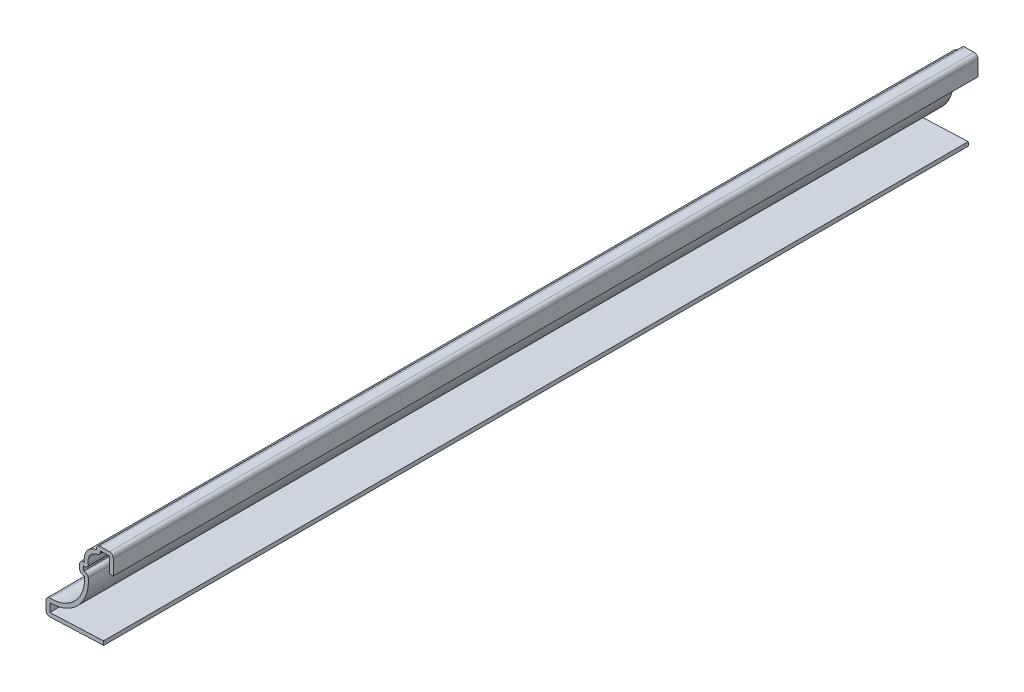
ISO-10303-21;
HEADER;
FILE_DESCRIPTION(('STEP AP214'),'2;1');
FILE_NAME('part.step','',(''),(''),'','','');
FILE_SCHEMA(('AUTOMOTIVE_DESIGN { 1 0 10303 214 1 1 1 1 }'));
ENDSEC;
DATA;
#1=APPLICATION_CONTEXT('core data for automotive mechanical design processes');
#2=APPLICATION_PROTOCOL_DEFINITION('international standard','automotive_design',2000,#1);
#3=PRODUCT_CONTEXT('',#1,'mechanical');
#4=PRODUCT('Part','Part','',(#3));
#5=PRODUCT_RELATED_PRODUCT_CATEGORY('part','',(#4));
#6=PRODUCT_DEFINITION_FORMATION('','',#4);
#7=PRODUCT_DEFINITION_CONTEXT('part definition',#1,'design');
#8=PRODUCT_DEFINITION('design','',#6,#7);
#9=PRODUCT_DEFINITION_SHAPE('','',#8);
#10=(LENGTH_UNIT() NAMED_UNIT(*) SI_UNIT(.MILLI.,.METRE.));
#11=(NAMED_UNIT(*) PLANE_ANGLE_UNIT() SI_UNIT($,.RADIAN.));
#12=(NAMED_UNIT(*) SI_UNIT($,.STERADIAN.) SOLID_ANGLE_UNIT());
#13=UNCERTAINTY_MEASURE_WITH_UNIT(LENGTH_MEASURE(1.E-05),#10,'distance_accuracy_value','');
#14=(GEOMETRIC_REPRESENTATION_CONTEXT(3) GLOBAL_UNCERTAINTY_ASSIGNED_CONTEXT((#13)) GLOBAL_UNIT_ASSIGNED_CONTEXT((#10,
#11,#12)) REPRESENTATION_CONTEXT('',''));
#15=CARTESIAN_POINT('',(0.,0.,0.));
#16=DIRECTION('',(0.,0.,1.));
#17=DIRECTION('',(1.,0.,0.));
#18=AXIS2_PLACEMENT_3D('',#15,#16,#17);
#19=CARTESIAN_POINT('',(1.905,27.78125,-285.75));
#20=DIRECTION('',(-1.,0.,0.));
#21=DIRECTION('',(0.,-1.,0.));
#22=AXIS2_PLACEMENT_3D('',#19,#20,#21);
#23=PLANE('',#22);
#24=DIRECTION('',(0.,-1.,0.));
#25=VECTOR('',#24,1.);
#26=CARTESIAN_POINT('',(1.905,27.78125,0.));
#27=LINE('',#26,#25);
#28=CARTESIAN_POINT('',(1.905,26.51125,0.));
#29=VERTEX_POINT('',#28);
#30=CARTESIAN_POINT('',(1.905,21.43125,0.));
#31=VERTEX_POINT('',#30);
#32=EDGE_CURVE('E350',#29,#31,#27,.T.);
#33=ORIENTED_EDGE('',*,*,#32,.F.);
#34=DIRECTION('',(0.,0.,1.));
#35=VECTOR('',#34,1.);
#36=CARTESIAN_POINT('',(1.905,26.51125,-285.75));
#37=LINE('',#36,#35);
#38=CARTESIAN_POINT('',(1.905,26.51125,-285.75));
#39=VERTEX_POINT('',#38);
#40=EDGE_CURVE('E274',#39,#29,#37,.T.);
#41=ORIENTED_EDGE('',*,*,#40,.F.);
#42=DIRECTION('',(0.,-1.,0.));
#43=VECTOR('',#42,1.);
#44=CARTESIAN_POINT('',(1.905,27.78125,-285.75));
#45=LINE('',#44,#43);
#46=CARTESIAN_POINT('',(1.905,21.43125,-285.75));
#47=VERTEX_POINT('',#46);
#48=EDGE_CURVE('E253',#39,#47,#45,.T.);
#49=ORIENTED_EDGE('',*,*,#48,.T.);
#50=DIRECTION('',(0.,0.,1.));
#51=VECTOR('',#50,1.);
#52=CARTESIAN_POINT('',(1.905,21.43125,-285.75));
#53=LINE('',#52,#51);
#54=EDGE_CURVE('E263',#47,#31,#53,.T.);
#55=ORIENTED_EDGE('',*,*,#54,.T.);
#56=EDGE_LOOP('',(#33,#41,#49,#55));
#57=FACE_BOUND('',#56,.T.);
#58=ADVANCED_FACE('F41',(#57),#23,.T.);
#59=CARTESIAN_POINT('',(-2.38125,26.51125,-285.75));
#60=DIRECTION('',(0.,-1.,0.));
#61=DIRECTION('',(0.,0.,-1.));
#62=AXIS2_PLACEMENT_3D('',#59,#60,#61);
#63=PLANE('',#62);
#64=DIRECTION('',(1.,0.,0.));
#65=VECTOR('',#64,1.);
#66=CARTESIAN_POINT('',(-2.38125,26.51125,0.));
#67=LINE('',#66,#65);
#68=CARTESIAN_POINT('',(-1.11125,26.51125,0.));
#69=VERTEX_POINT('',#68);
#70=EDGE_CURVE('E276',#69,#29,#67,.T.);
#71=ORIENTED_EDGE('',*,*,#70,.F.);
#72=DIRECTION('',(0.,0.,1.));
#73=VECTOR('',#72,1.);
#74=CARTESIAN_POINT('',(-1.11125,26.51125,-285.75));
#75=LINE('',#74,#73);
#76=CARTESIAN_POINT('',(-1.11125,26.51125,-285.75));
#77=VERTEX_POINT('',#76);
#78=EDGE_CURVE('E425',#77,#69,#75,.T.);
#79=ORIENTED_EDGE('',*,*,#78,.F.);
#80=DIRECTION('',(1.,0.,0.));
#81=VECTOR('',#80,1.);
#82=CARTESIAN_POINT('',(-2.38125,26.51125,-285.75));
#83=LINE('',#82,#81);
#84=EDGE_CURVE('E272',#77,#39,#83,.T.);
#85=ORIENTED_EDGE('',*,*,#84,.T.);
#86=ORIENTED_EDGE('',*,*,#40,.T.);
#87=EDGE_LOOP('',(#71,#79,#85,#86));
#88=FACE_BOUND('',#87,.T.);
#89=ADVANCED_FACE('F638',(#88),#63,.T.);
#90=CARTESIAN_POINT('',(-1.11125,26.19375,-285.75));
#91=DIRECTION('',(1.,0.,0.));
#92=DIRECTION('',(0.,1.,0.));
#93=AXIS2_PLACEMENT_3D('',#90,#91,#92);
#94=PLANE('',#93);
#95=DIRECTION('',(0.,1.,0.));
#96=VECTOR('',#95,1.);
#97=CARTESIAN_POINT('',(-1.11125,26.19375,0.));
#98=LINE('',#97,#96);
#99=CARTESIAN_POINT('',(-1.11125,26.19375,0.));
#100=VERTEX_POINT('',#99);
#101=EDGE_CURVE('E280',#100,#69,#98,.T.);
#102=ORIENTED_EDGE('',*,*,#101,.F.);
#103=DIRECTION('',(0.,0.,1.));
#104=VECTOR('',#103,1.);
#105=CARTESIAN_POINT('',(-1.11125,26.19375,-285.75));
#106=LINE('',#105,#104);
#107=CARTESIAN_POINT('',(-1.11125,26.19375,-285.75));
#108=VERTEX_POINT('',#107);
#109=EDGE_CURVE('E533',#100,#108,#106,.F.);
#110=ORIENTED_EDGE('',*,*,#109,.T.);
#111=DIRECTION('',(0.,1.,0.));
#112=VECTOR('',#111,1.);
#113=CARTESIAN_POINT('',(-1.11125,26.19375,-285.75));
#114=LINE('',#113,#112);
#115=EDGE_CURVE('E345',#108,#77,#114,.T.);
#116=ORIENTED_EDGE('',*,*,#115,.T.);
#117=ORIENTED_EDGE('',*,*,#78,.T.);
#118=EDGE_LOOP('',(#102,#110,#116,#117));
#119=FACE_BOUND('',#118,.T.);
#120=ADVANCED_FACE('F643',(#119),#94,.T.);
#121=CARTESIAN_POINT('',(-1.66362750041689,21.4856267860121,-285.75));
#122=DIRECTION('',(0.,0.,1.));
#123=DIRECTION('',(1.,0.,0.));
#124=AXIS2_PLACEMENT_3D('',#121,#122,#123);
#125=CYLINDRICAL_SURFACE('',#124,3.4925);
#126=CARTESIAN_POINT('',(-1.66362750041689,21.4856267860121,-285.75));
#127=DIRECTION('',(0.,0.,1.));
#128=DIRECTION('',(1.,0.,0.));
#129=AXIS2_PLACEMENT_3D('',#126,#127,#128);
#130=CIRCLE('',#129,3.4925);
#131=CARTESIAN_POINT('',(-5.10030066677784,20.8636671429366,-285.75));
#132=VERTEX_POINT('',#131);
#133=CARTESIAN_POINT('',(-2.18988400011117,24.9382504762699,-285.75));
#134=VERTEX_POINT('',#133);
#135=EDGE_CURVE('E341',#132,#134,#130,.F.);
#136=ORIENTED_EDGE('',*,*,#135,.T.);
#137=DIRECTION('',(0.,0.,1.));
#138=VECTOR('',#137,1.);
#139=CARTESIAN_POINT('',(-2.18988400011117,24.9382504762699,-285.75));
#140=LINE('',#139,#138);
#141=CARTESIAN_POINT('',(-2.18988400011117,24.9382504762699,0.));
#142=VERTEX_POINT('',#141);
#143=EDGE_CURVE('E529',#134,#142,#140,.T.);
#144=ORIENTED_EDGE('',*,*,#143,.T.);
#145=CARTESIAN_POINT('',(-1.66362750041689,21.4856267860121,0.));
#146=DIRECTION('',(0.,0.,1.));
#147=DIRECTION('',(1.,0.,0.));
#148=AXIS2_PLACEMENT_3D('',#145,#146,#147);
#149=CIRCLE('',#148,3.4925);
#150=CARTESIAN_POINT('',(-5.10030066677784,20.8636671429366,0.));
#151=VERTEX_POINT('',#150);
#152=EDGE_CURVE('E416',#151,#142,#149,.F.);
#153=ORIENTED_EDGE('',*,*,#152,.F.);
#154=DIRECTION('',(0.,0.,1.));
#155=VECTOR('',#154,1.);
#156=CARTESIAN_POINT('',(-5.10030066677784,20.8636671429366,-285.75));
#157=LINE('',#156,#155);
#158=EDGE_CURVE('E526',#151,#132,#157,.F.);
#159=ORIENTED_EDGE('',*,*,#158,.T.);
#160=EDGE_LOOP('',(#136,#144,#153,#159));
#161=FACE_BOUND('',#160,.T.);
#162=ADVANCED_FACE('F850',(#161),#125,.F.);
#163=CARTESIAN_POINT('',(-7.9375,19.3675,-285.75));
#164=DIRECTION('',(0.,-1.,0.));
#165=DIRECTION('',(0.,0.,-1.));
#166=AXIS2_PLACEMENT_3D('',#163,#164,#165);
#167=PLANE('',#166);
#168=DIRECTION('',(1.,0.,0.));
#169=VECTOR('',#168,1.);
#170=CARTESIAN_POINT('',(-7.9375,19.3675,-285.75));
#171=LINE('',#170,#169);
#172=CARTESIAN_POINT('',(-6.6675,19.3675,-285.75));
#173=VERTEX_POINT('',#172);
#174=CARTESIAN_POINT('',(-6.35,19.3675,-285.75));
#175=VERTEX_POINT('',#174);
#176=EDGE_CURVE('E337',#173,#175,#171,.T.);
#177=ORIENTED_EDGE('',*,*,#176,.T.);
#178=DIRECTION('',(0.,0.,1.));
#179=VECTOR('',#178,1.);
#180=CARTESIAN_POINT('',(-6.35,19.3675,-285.75));
#181=LINE('',#180,#179);
#182=CARTESIAN_POINT('',(-6.35,19.3675,0.));
#183=VERTEX_POINT('',#182);
#184=EDGE_CURVE('E545',#175,#183,#181,.T.);
#185=ORIENTED_EDGE('',*,*,#184,.T.);
#186=DIRECTION('',(1.,0.,0.));
#187=VECTOR('',#186,1.);
#188=CARTESIAN_POINT('',(-7.9375,19.3675,0.));
#189=LINE('',#188,#187);
#190=CARTESIAN_POINT('',(-6.6675,19.3675,0.));
#191=VERTEX_POINT('',#190);
#192=EDGE_CURVE('E412',#191,#183,#189,.T.);
#193=ORIENTED_EDGE('',*,*,#192,.F.);
#194=DIRECTION('',(0.,0.,1.));
#195=VECTOR('',#194,1.);
#196=CARTESIAN_POINT('',(-6.6675,19.3675,-285.75));
#197=LINE('',#196,#195);
#198=EDGE_CURVE('E429',#173,#191,#197,.T.);
#199=ORIENTED_EDGE('',*,*,#198,.F.);
#200=EDGE_LOOP('',(#177,#185,#193,#199));
#201=FACE_BOUND('',#200,.T.);
#202=ADVANCED_FACE('F845',(#201),#167,.T.);
#203=CARTESIAN_POINT('',(-6.6675,16.66875,-285.75));
#204=DIRECTION('',(1.,0.,0.));
#205=DIRECTION('',(0.,0.,-1.));
#206=AXIS2_PLACEMENT_3D('',#203,#204,#205);
#207=PLANE('',#206);
#208=DIRECTION('',(0.,1.,0.));
#209=VECTOR('',#208,1.);
#210=CARTESIAN_POINT('',(-6.6675,16.66875,0.));
#211=LINE('',#210,#209);
#212=CARTESIAN_POINT('',(-6.6675,17.93875,0.));
#213=VERTEX_POINT('',#212);
#214=EDGE_CURVE('E408',#213,#191,#211,.T.);
#215=ORIENTED_EDGE('',*,*,#214,.F.);
#216=DIRECTION('',(0.,0.,1.));
#217=VECTOR('',#216,1.);
#218=CARTESIAN_POINT('',(-6.6675,17.93875,-285.75));
#219=LINE('',#218,#217);
#220=CARTESIAN_POINT('',(-6.6675,17.93875,-285.75));
#221=VERTEX_POINT('',#220);
#222=EDGE_CURVE('E432',#221,#213,#219,.T.);
#223=ORIENTED_EDGE('',*,*,#222,.F.);
#224=DIRECTION('',(0.,1.,0.));
#225=VECTOR('',#224,1.);
#226=CARTESIAN_POINT('',(-6.6675,16.66875,-285.75));
#227=LINE('',#226,#225);
#228=EDGE_CURVE('E333',#221,#173,#227,.T.);
#229=ORIENTED_EDGE('',*,*,#228,.T.);
#230=ORIENTED_EDGE('',*,*,#198,.T.);
#231=EDGE_LOOP('',(#215,#223,#229,#230));
#232=FACE_BOUND('',#231,.T.);
#233=ADVANCED_FACE('F837',(#232),#207,.T.);
#234=CARTESIAN_POINT('',(-6.35,17.93875,-285.75));
#235=DIRECTION('',(0.,1.,0.));
#236=DIRECTION('',(0.,0.,1.));
#237=AXIS2_PLACEMENT_3D('',#234,#235,#236);
#238=PLANE('',#237);
#239=DIRECTION('',(1.,0.,0.));
#240=VECTOR('',#239,1.);
#241=CARTESIAN_POINT('',(-6.35,17.93875,0.));
#242=LINE('',#241,#240);
#243=CARTESIAN_POINT('',(-6.35,17.93875,0.));
#244=VERTEX_POINT('',#243);
#245=EDGE_CURVE('E405',#244,#213,#242,.F.);
#246=ORIENTED_EDGE('',*,*,#245,.F.);
#247=DIRECTION('',(0.,0.,1.));
#248=VECTOR('',#247,1.);
#249=CARTESIAN_POINT('',(-6.35,17.93875,-285.75));
#250=LINE('',#249,#248);
#251=CARTESIAN_POINT('',(-6.35,17.93875,-285.75));
#252=VERTEX_POINT('',#251);
#253=EDGE_CURVE('E542',#244,#252,#250,.F.);
#254=ORIENTED_EDGE('',*,*,#253,.T.);
#255=DIRECTION('',(1.,0.,0.));
#256=VECTOR('',#255,1.);
#257=CARTESIAN_POINT('',(-6.35,17.93875,-285.75));
#258=LINE('',#257,#256);
#259=EDGE_CURVE('E330',#252,#221,#258,.F.);
#260=ORIENTED_EDGE('',*,*,#259,.T.);
#261=ORIENTED_EDGE('',*,*,#222,.T.);
#262=EDGE_LOOP('',(#246,#254,#260,#261));
#263=FACE_BOUND('',#262,.T.);
#264=ADVANCED_FACE('F825',(#263),#238,.T.);
#265=CARTESIAN_POINT('',(-17.4249125813305,15.7555317534192,-285.75));
#266=DIRECTION('',(0.,0.,1.));
#267=DIRECTION('',(1.,0.,0.));
#268=AXIS2_PLACEMENT_3D('',#265,#266,#267);
#269=CYLINDRICAL_SURFACE('',#268,12.3825);
#270=CARTESIAN_POINT('',(-17.4249125813305,15.7555317534192,-285.75));
#271=DIRECTION('',(0.,0.,1.));
#272=DIRECTION('',(1.,0.,0.));
#273=AXIS2_PLACEMENT_3D('',#270,#271,#272);
#274=CIRCLE('',#273,12.3825);
#275=CARTESIAN_POINT('',(-17.78,3.37812414216621,-285.75));
#276=VERTEX_POINT('',#275);
#277=CARTESIAN_POINT('',(-5.08429570499081,16.7731177996092,-285.75));
#278=VERTEX_POINT('',#277);
#279=EDGE_CURVE('E326',#276,#278,#274,.T.);
#280=ORIENTED_EDGE('',*,*,#279,.T.);
#281=DIRECTION('',(0.,0.,1.));
#282=VECTOR('',#281,1.);
#283=CARTESIAN_POINT('',(-5.0842957049908,16.7731177996092,-285.75));
#284=LINE('',#283,#282);
#285=CARTESIAN_POINT('',(-5.08429570499081,16.7731177996092,0.));
#286=VERTEX_POINT('',#285);
#287=EDGE_CURVE('E538',#278,#286,#284,.T.);
#288=ORIENTED_EDGE('',*,*,#287,.T.);
#289=CARTESIAN_POINT('',(-17.4249125813305,15.7555317534192,0.));
#290=DIRECTION('',(0.,0.,1.));
#291=DIRECTION('',(1.,0.,0.));
#292=AXIS2_PLACEMENT_3D('',#289,#290,#291);
#293=CIRCLE('',#292,12.3825);
#294=CARTESIAN_POINT('',(-17.78,3.37812414216621,0.));
#295=VERTEX_POINT('',#294);
#296=EDGE_CURVE('E401',#295,#286,#293,.T.);
#297=ORIENTED_EDGE('',*,*,#296,.F.);
#298=DIRECTION('',(0.,0.,1.));
#299=VECTOR('',#298,1.);
#300=CARTESIAN_POINT('',(-17.78,3.37812414216621,-285.75));
#301=LINE('',#300,#299);
#302=EDGE_CURVE('E436',#276,#295,#301,.T.);
#303=ORIENTED_EDGE('',*,*,#302,.F.);
#304=EDGE_LOOP('',(#280,#288,#297,#303));
#305=FACE_BOUND('',#304,.T.);
#306=ADVANCED_FACE('F819',(#305),#269,.T.);
#307=CARTESIAN_POINT('',(-17.78,-0.79375,-285.75));
#308=DIRECTION('',(1.,0.,0.));
#309=DIRECTION('',(0.,0.,-1.));
#310=AXIS2_PLACEMENT_3D('',#307,#308,#309);
#311=PLANE('',#310);
#312=DIRECTION('',(0.,1.,0.));
#313=VECTOR('',#312,1.);
#314=CARTESIAN_POINT('',(-17.78,-0.79375,0.));
#315=LINE('',#314,#313);
#316=CARTESIAN_POINT('',(-17.78,0.53026861915164,0.));
#317=VERTEX_POINT('',#316);
#318=EDGE_CURVE('E397',#317,#295,#315,.T.);
#319=ORIENTED_EDGE('',*,*,#318,.F.);
#320=DIRECTION('',(0.,0.,1.));
#321=VECTOR('',#320,1.);
#322=CARTESIAN_POINT('',(-17.78,0.53026861915164,-285.75));
#323=LINE('',#322,#321);
#324=CARTESIAN_POINT('',(-17.78,0.53026861915164,-285.75));
#325=VERTEX_POINT('',#324);
#326=EDGE_CURVE('E439',#325,#317,#323,.T.);
#327=ORIENTED_EDGE('',*,*,#326,.F.);
#328=DIRECTION('',(0.,1.,0.));
#329=VECTOR('',#328,1.);
#330=CARTESIAN_POINT('',(-17.78,-0.79375,-285.75));
#331=LINE('',#330,#329);
#332=EDGE_CURVE('E322',#325,#276,#331,.T.);
#333=ORIENTED_EDGE('',*,*,#332,.T.);
#334=ORIENTED_EDGE('',*,*,#302,.T.);
#335=EDGE_LOOP('',(#319,#327,#333,#334));
#336=FACE_BOUND('',#335,.T.);
#337=ADVANCED_FACE('F824',(#336),#311,.T.);
#338=CARTESIAN_POINT('',(-0.0528707917844703,1.26889900282729,-285.75));
#339=DIRECTION('',(-0.0416305447121813,0.999133073092352,0.));
#340=DIRECTION('',(-0.999133073092352,-0.0416305447121813,0.));
#341=AXIS2_PLACEMENT_3D('',#338,#339,#340);
#342=PLANE('',#341);
#343=DIRECTION('',(-0.999133073092352,-0.0416305447121813,0.));
#344=VECTOR('',#343,1.);
#345=CARTESIAN_POINT('',(-0.0528707917844703,1.26889900282729,0.));
#346=LINE('',#345,#344);
#347=CARTESIAN_POINT('',(-0.0528707917844703,1.26889900282729,0.));
#348=VERTEX_POINT('',#347);
#349=EDGE_CURVE('E393',#348,#317,#346,.T.);
#350=ORIENTED_EDGE('',*,*,#349,.F.);
#351=DIRECTION('',(0.,0.,1.));
#352=VECTOR('',#351,1.);
#353=CARTESIAN_POINT('',(-0.0528707917844703,1.26889900282729,-285.75));
#354=LINE('',#353,#352);
#355=CARTESIAN_POINT('',(-0.0528707917844703,1.26889900282729,-285.75));
#356=VERTEX_POINT('',#355);
#357=EDGE_CURVE('E442',#356,#348,#354,.T.);
#358=ORIENTED_EDGE('',*,*,#357,.F.);
#359=DIRECTION('',(-0.999133073092352,-0.0416305447121813,0.));
#360=VECTOR('',#359,1.);
#361=CARTESIAN_POINT('',(-0.0528707917844703,1.26889900282729,-285.75));
#362=LINE('',#361,#360);
#363=EDGE_CURVE('E318',#356,#325,#362,.T.);
#364=ORIENTED_EDGE('',*,*,#363,.T.);
#365=ORIENTED_EDGE('',*,*,#326,.T.);
#366=EDGE_LOOP('',(#350,#358,#364,#365));
#367=FACE_BOUND('',#366,.T.);
#368=ADVANCED_FACE('F887',(#367),#342,.T.);
#369=CARTESIAN_POINT('',(-0.0528707917844703,1.26889900282729,-285.75));
#370=DIRECTION('',(-0.999133073092352,-0.0416305447121813,0.));
#371=DIRECTION('',(0.0416305447121813,-0.999133073092352,0.));
#372=AXIS2_PLACEMENT_3D('',#369,#370,#371);
#373=PLANE('',#372);
#374=DIRECTION('',(0.0416305447121813,-0.999133073092352,0.));
#375=VECTOR('',#374,1.);
#376=CARTESIAN_POINT('',(-0.0528707917844703,1.26889900282729,0.));
#377=LINE('',#376,#375);
#378=CARTESIAN_POINT('',(0.,0.,0.));
#379=VERTEX_POINT('',#378);
#380=EDGE_CURVE('E390',#348,#379,#377,.T.);
#381=ORIENTED_EDGE('',*,*,#380,.T.);
#382=DIRECTION('',(0.,0.,1.));
#383=VECTOR('',#382,1.);
#384=CARTESIAN_POINT('',(0.,0.,-285.75));
#385=LINE('',#384,#383);
#386=CARTESIAN_POINT('',(0.,0.,-285.75));
#387=VERTEX_POINT('',#386);
#388=EDGE_CURVE('E445',#387,#379,#385,.T.);
#389=ORIENTED_EDGE('',*,*,#388,.F.);
#390=DIRECTION('',(0.0416305447121813,-0.999133073092352,0.));
#391=VECTOR('',#390,1.);
#392=CARTESIAN_POINT('',(-0.0528707917844703,1.26889900282729,-285.75));
#393=LINE('',#392,#391);
#394=EDGE_CURVE('E315',#356,#387,#393,.T.);
#395=ORIENTED_EDGE('',*,*,#394,.F.);
#396=ORIENTED_EDGE('',*,*,#357,.T.);
#397=EDGE_LOOP('',(#381,#389,#395,#396));
#398=FACE_BOUND('',#397,.T.);
#399=ADVANCED_FACE('F812',(#398),#373,.F.);
#400=CARTESIAN_POINT('',(0.,0.,-285.75));
#401=DIRECTION('',(-0.0416305447121813,0.999133073092352,0.));
#402=DIRECTION('',(-0.999133073092352,-0.0416305447121813,0.));
#403=AXIS2_PLACEMENT_3D('',#400,#401,#402);
#404=PLANE('',#403);
#405=DIRECTION('',(-0.999133073092352,-0.0416305447121813,0.));
#406=VECTOR('',#405,1.);
#407=CARTESIAN_POINT('',(0.,0.,0.));
#408=LINE('',#407,#406);
#409=CARTESIAN_POINT('',(-17.7271292082155,-0.738630383675647,0.));
#410=VERTEX_POINT('',#409);
#411=EDGE_CURVE('E386',#379,#410,#408,.T.);
#412=ORIENTED_EDGE('',*,*,#411,.T.);
#413=DIRECTION('',(0.,0.,1.));
#414=VECTOR('',#413,1.);
#415=CARTESIAN_POINT('',(-17.7271292082155,-0.738630383675647,-285.75));
#416=LINE('',#415,#414);
#417=CARTESIAN_POINT('',(-17.7271292082155,-0.738630383675647,-285.75));
#418=VERTEX_POINT('',#417);
#419=EDGE_CURVE('E50',#410,#418,#416,.F.);
#420=ORIENTED_EDGE('',*,*,#419,.T.);
#421=DIRECTION('',(-0.999133073092352,-0.0416305447121813,0.));
#422=VECTOR('',#421,1.);
#423=CARTESIAN_POINT('',(0.,0.,-285.75));
#424=LINE('',#423,#422);
#425=EDGE_CURVE('E311',#387,#418,#424,.T.);
#426=ORIENTED_EDGE('',*,*,#425,.F.);
#427=ORIENTED_EDGE('',*,*,#388,.T.);
#428=EDGE_LOOP('',(#412,#420,#426,#427));
#429=FACE_BOUND('',#428,.T.);
#430=ADVANCED_FACE('F573',(#429),#404,.F.);
#431=CARTESIAN_POINT('',(-19.05,-0.79375,-285.75));
#432=DIRECTION('',(1.,0.,0.));
#433=DIRECTION('',(0.,0.,-1.));
#434=AXIS2_PLACEMENT_3D('',#431,#432,#433);
#435=PLANE('',#434);
#436=DIRECTION('',(0.,1.,0.));
#437=VECTOR('',#436,1.);
#438=CARTESIAN_POINT('',(-19.05,-0.79375,-285.75));
#439=LINE('',#438,#437);
#440=CARTESIAN_POINT('',(-19.05,0.530268619151639,-285.75));
#441=VERTEX_POINT('',#440);
#442=CARTESIAN_POINT('',(-19.05,3.37812414216621,-285.75));
#443=VERTEX_POINT('',#442);
#444=EDGE_CURVE('E307',#441,#443,#439,.T.);
#445=ORIENTED_EDGE('',*,*,#444,.F.);
#446=DIRECTION('',(0.,0.,1.));
#447=VECTOR('',#446,1.);
#448=CARTESIAN_POINT('',(-19.05,0.530268619151639,-285.75));
#449=LINE('',#448,#447);
#450=CARTESIAN_POINT('',(-19.05,0.530268619151639,0.));
#451=VERTEX_POINT('',#450);
#452=EDGE_CURVE('E566',#441,#451,#449,.T.);
#453=ORIENTED_EDGE('',*,*,#452,.T.);
#454=DIRECTION('',(0.,1.,0.));
#455=VECTOR('',#454,1.);
#456=CARTESIAN_POINT('',(-19.05,-0.79375,0.));
#457=LINE('',#456,#455);
#458=CARTESIAN_POINT('',(-19.05,3.37812414216621,0.));
#459=VERTEX_POINT('',#458);
#460=EDGE_CURVE('E382',#451,#459,#457,.T.);
#461=ORIENTED_EDGE('',*,*,#460,.T.);
#462=DIRECTION('',(0.,0.,1.));
#463=VECTOR('',#462,1.);
#464=CARTESIAN_POINT('',(-19.05,3.37812414216621,-285.75));
#465=LINE('',#464,#463);
#466=EDGE_CURVE('E563',#459,#443,#465,.F.);
#467=ORIENTED_EDGE('',*,*,#466,.T.);
#468=EDGE_LOOP('',(#445,#453,#461,#467));
#469=FACE_BOUND('',#468,.T.);
#470=ADVANCED_FACE('F585',(#469),#435,.F.);
#471=CARTESIAN_POINT('',(-17.4249125813305,15.7555317534192,-285.75));
#472=DIRECTION('',(0.,0.,1.));
#473=DIRECTION('',(1.,0.,0.));
#474=AXIS2_PLACEMENT_3D('',#471,#472,#473);
#475=CYLINDRICAL_SURFACE('',#474,11.1125);
#476=CARTESIAN_POINT('',(-17.4249125813305,15.7555317534192,-285.75));
#477=DIRECTION('',(0.,0.,1.));
#478=DIRECTION('',(1.,0.,0.));
#479=AXIS2_PLACEMENT_3D('',#476,#477,#478);
#480=CIRCLE('',#479,11.1125);
#481=CARTESIAN_POINT('',(-17.7435807775724,4.64760184588446,-285.75));
#482=VERTEX_POINT('',#481);
#483=CARTESIAN_POINT('',(-6.35,16.66875,-285.75));
#484=VERTEX_POINT('',#483);
#485=EDGE_CURVE('E304',#482,#484,#480,.T.);
#486=ORIENTED_EDGE('',*,*,#485,.F.);
#487=DIRECTION('',(0.,0.,1.));
#488=VECTOR('',#487,1.);
#489=CARTESIAN_POINT('',(-17.7435807775724,4.64760184588446,-285.75));
#490=LINE('',#489,#488);
#491=CARTESIAN_POINT('',(-17.7435807775724,4.64760184588446,0.));
#492=VERTEX_POINT('',#491);
#493=EDGE_CURVE('E11',#482,#492,#490,.T.);
#494=ORIENTED_EDGE('',*,*,#493,.T.);
#495=CARTESIAN_POINT('',(-17.4249125813305,15.7555317534192,0.));
#496=DIRECTION('',(0.,0.,1.));
#497=DIRECTION('',(1.,0.,0.));
#498=AXIS2_PLACEMENT_3D('',#495,#496,#497);
#499=CIRCLE('',#498,11.1125);
#500=CARTESIAN_POINT('',(-6.35,16.66875,0.));
#501=VERTEX_POINT('',#500);
#502=EDGE_CURVE('E379',#492,#501,#499,.T.);
#503=ORIENTED_EDGE('',*,*,#502,.T.);
#504=DIRECTION('',(0.,0.,1.));
#505=VECTOR('',#504,1.);
#506=CARTESIAN_POINT('',(-6.35,16.66875,-285.75));
#507=LINE('',#506,#505);
#508=EDGE_CURVE('E449',#484,#501,#507,.T.);
#509=ORIENTED_EDGE('',*,*,#508,.F.);
#510=EDGE_LOOP('',(#486,#494,#503,#509));
#511=FACE_BOUND('',#510,.T.);
#512=ADVANCED_FACE('F597',(#511),#475,.F.);
#513=CARTESIAN_POINT('',(-6.35,16.66875,-285.75));
#514=DIRECTION('',(0.,1.,0.));
#515=DIRECTION('',(0.,0.,1.));
#516=AXIS2_PLACEMENT_3D('',#513,#514,#515);
#517=PLANE('',#516);
#518=DIRECTION('',(-1.,0.,0.));
#519=VECTOR('',#518,1.);
#520=CARTESIAN_POINT('',(-6.35,16.66875,0.));
#521=LINE('',#520,#519);
#522=CARTESIAN_POINT('',(-6.6675,16.66875,0.));
#523=VERTEX_POINT('',#522);
#524=EDGE_CURVE('E375',#501,#523,#521,.T.);
#525=ORIENTED_EDGE('',*,*,#524,.T.);
#526=DIRECTION('',(0.,0.,1.));
#527=VECTOR('',#526,1.);
#528=CARTESIAN_POINT('',(-6.6675,16.66875,-285.75));
#529=LINE('',#528,#527);
#530=CARTESIAN_POINT('',(-6.6675,16.66875,-285.75));
#531=VERTEX_POINT('',#530);
#532=EDGE_CURVE('E556',#523,#531,#529,.F.);
#533=ORIENTED_EDGE('',*,*,#532,.T.);
#534=DIRECTION('',(-1.,0.,0.));
#535=VECTOR('',#534,1.);
#536=CARTESIAN_POINT('',(-6.35,16.66875,-285.75));
#537=LINE('',#536,#535);
#538=EDGE_CURVE('E300',#484,#531,#537,.T.);
#539=ORIENTED_EDGE('',*,*,#538,.F.);
#540=ORIENTED_EDGE('',*,*,#508,.T.);
#541=EDGE_LOOP('',(#525,#533,#539,#540));
#542=FACE_BOUND('',#541,.T.);
#543=ADVANCED_FACE('F779',(#542),#517,.F.);
#544=CARTESIAN_POINT('',(-7.9375,16.66875,-285.75));
#545=DIRECTION('',(1.,0.,0.));
#546=DIRECTION('',(0.,0.,-1.));
#547=AXIS2_PLACEMENT_3D('',#544,#545,#546);
#548=PLANE('',#547);
#549=DIRECTION('',(0.,1.,0.));
#550=VECTOR('',#549,1.);
#551=CARTESIAN_POINT('',(-7.9375,16.66875,-285.75));
#552=LINE('',#551,#550);
#553=CARTESIAN_POINT('',(-7.9375,17.93875,-285.75));
#554=VERTEX_POINT('',#553);
#555=CARTESIAN_POINT('',(-7.9375,19.3675,-285.75));
#556=VERTEX_POINT('',#555);
#557=EDGE_CURVE('E297',#554,#556,#552,.T.);
#558=ORIENTED_EDGE('',*,*,#557,.F.);
#559=DIRECTION('',(0.,0.,1.));
#560=VECTOR('',#559,1.);
#561=CARTESIAN_POINT('',(-7.9375,17.93875,-285.75));
#562=LINE('',#561,#560);
#563=CARTESIAN_POINT('',(-7.9375,17.93875,0.));
#564=VERTEX_POINT('',#563);
#565=EDGE_CURVE('E552',#554,#564,#562,.T.);
#566=ORIENTED_EDGE('',*,*,#565,.T.);
#567=DIRECTION('',(0.,1.,0.));
#568=VECTOR('',#567,1.);
#569=CARTESIAN_POINT('',(-7.9375,16.66875,0.));
#570=LINE('',#569,#568);
#571=CARTESIAN_POINT('',(-7.9375,19.3675,0.));
#572=VERTEX_POINT('',#571);
#573=EDGE_CURVE('E371',#564,#572,#570,.T.);
#574=ORIENTED_EDGE('',*,*,#573,.T.);
#575=DIRECTION('',(0.,0.,1.));
#576=VECTOR('',#575,1.);
#577=CARTESIAN_POINT('',(-7.9375,19.3675,-285.75));
#578=LINE('',#577,#576);
#579=EDGE_CURVE('E549',#572,#556,#578,.F.);
#580=ORIENTED_EDGE('',*,*,#579,.T.);
#581=EDGE_LOOP('',(#558,#566,#574,#580));
#582=FACE_BOUND('',#581,.T.);
#583=ADVANCED_FACE('F609',(#582),#548,.F.);
#584=CARTESIAN_POINT('',(-7.9375,20.6375,-285.75));
#585=DIRECTION('',(0.,-1.,0.));
#586=DIRECTION('',(0.,0.,-1.));
#587=AXIS2_PLACEMENT_3D('',#584,#585,#586);
#588=PLANE('',#587);
#589=DIRECTION('',(1.,0.,0.));
#590=VECTOR('',#589,1.);
#591=CARTESIAN_POINT('',(-7.9375,20.6375,-285.75));
#592=LINE('',#591,#590);
#593=CARTESIAN_POINT('',(-6.6675,20.6375,-285.75));
#594=VERTEX_POINT('',#593);
#595=CARTESIAN_POINT('',(-6.35,20.6375,-285.75));
#596=VERTEX_POINT('',#595);
#597=EDGE_CURVE('E294',#594,#596,#592,.T.);
#598=ORIENTED_EDGE('',*,*,#597,.F.);
#599=DIRECTION('',(0.,0.,1.));
#600=VECTOR('',#599,1.);
#601=CARTESIAN_POINT('',(-6.6675,20.6375,-285.75));
#602=LINE('',#601,#600);
#603=CARTESIAN_POINT('',(-6.6675,20.6375,0.));
#604=VERTEX_POINT('',#603);
#605=EDGE_CURVE('E559',#594,#604,#602,.T.);
#606=ORIENTED_EDGE('',*,*,#605,.T.);
#607=DIRECTION('',(1.,0.,0.));
#608=VECTOR('',#607,1.);
#609=CARTESIAN_POINT('',(-7.9375,20.6375,0.));
#610=LINE('',#609,#608);
#611=CARTESIAN_POINT('',(-6.35,20.6375,0.));
#612=VERTEX_POINT('',#611);
#613=EDGE_CURVE('E368',#604,#612,#610,.T.);
#614=ORIENTED_EDGE('',*,*,#613,.T.);
#615=DIRECTION('',(0.,0.,1.));
#616=VECTOR('',#615,1.);
#617=CARTESIAN_POINT('',(-6.35,20.6375,-285.75));
#618=LINE('',#617,#616);
#619=EDGE_CURVE('E453',#596,#612,#618,.T.);
#620=ORIENTED_EDGE('',*,*,#619,.F.);
#621=EDGE_LOOP('',(#598,#606,#614,#620));
#622=FACE_BOUND('',#621,.T.);
#623=ADVANCED_FACE('F617',(#622),#588,.F.);
#624=CARTESIAN_POINT('',(-1.66362750041689,21.4856267860121,-285.75));
#625=DIRECTION('',(0.,0.,1.));
#626=DIRECTION('',(1.,0.,0.));
#627=AXIS2_PLACEMENT_3D('',#624,#625,#626);
#628=CYLINDRICAL_SURFACE('',#627,4.7625);
#629=CARTESIAN_POINT('',(-1.66362750041689,21.4856267860121,0.));
#630=DIRECTION('',(0.,0.,-1.));
#631=DIRECTION('',(-1.,0.,0.));
#632=AXIS2_PLACEMENT_3D('',#629,#630,#631);
#633=CIRCLE('',#632,4.7625);
#634=CARTESIAN_POINT('',(-2.38125,26.19375,0.));
#635=VERTEX_POINT('',#634);
#636=EDGE_CURVE('E365',#612,#635,#633,.T.);
#637=ORIENTED_EDGE('',*,*,#636,.T.);
#638=DIRECTION('',(0.,0.,1.));
#639=VECTOR('',#638,1.);
#640=CARTESIAN_POINT('',(-2.38125,26.19375,-285.75));
#641=LINE('',#640,#639);
#642=CARTESIAN_POINT('',(-2.38125,26.19375,-285.75));
#643=VERTEX_POINT('',#642);
#644=EDGE_CURVE('E457',#643,#635,#641,.T.);
#645=ORIENTED_EDGE('',*,*,#644,.F.);
#646=CARTESIAN_POINT('',(-1.66362750041689,21.4856267860121,-285.75));
#647=DIRECTION('',(0.,0.,-1.));
#648=DIRECTION('',(-1.,0.,0.));
#649=AXIS2_PLACEMENT_3D('',#646,#647,#648);
#650=CIRCLE('',#649,4.7625);
#651=EDGE_CURVE('E291',#596,#643,#650,.T.);
#652=ORIENTED_EDGE('',*,*,#651,.F.);
#653=ORIENTED_EDGE('',*,*,#619,.T.);
#654=EDGE_LOOP('',(#637,#645,#652,#653));
#655=FACE_BOUND('',#654,.T.);
#656=ADVANCED_FACE('F623',(#655),#628,.T.);
#657=CARTESIAN_POINT('',(-2.38125,26.19375,-285.75));
#658=DIRECTION('',(1.,0.,0.));
#659=DIRECTION('',(0.,1.,0.));
#660=AXIS2_PLACEMENT_3D('',#657,#658,#659);
#661=PLANE('',#660);
#662=DIRECTION('',(0.,1.,0.));
#663=VECTOR('',#662,1.);
#664=CARTESIAN_POINT('',(-2.38125,26.19375,0.));
#665=LINE('',#664,#663);
#666=CARTESIAN_POINT('',(-2.38125,26.51125,0.));
#667=VERTEX_POINT('',#666);
#668=EDGE_CURVE('E362',#635,#667,#665,.T.);
#669=ORIENTED_EDGE('',*,*,#668,.T.);
#670=DIRECTION('',(0.,0.,1.));
#671=VECTOR('',#670,1.);
#672=CARTESIAN_POINT('',(-2.38125,26.51125,-285.75));
#673=LINE('',#672,#671);
#674=CARTESIAN_POINT('',(-2.38125,26.51125,-285.75));
#675=VERTEX_POINT('',#674);
#676=EDGE_CURVE('E57',#667,#675,#673,.F.);
#677=ORIENTED_EDGE('',*,*,#676,.T.);
#678=DIRECTION('',(0.,1.,0.));
#679=VECTOR('',#678,1.);
#680=CARTESIAN_POINT('',(-2.38125,26.19375,-285.75));
#681=LINE('',#680,#679);
#682=EDGE_CURVE('E288',#643,#675,#681,.T.);
#683=ORIENTED_EDGE('',*,*,#682,.F.);
#684=ORIENTED_EDGE('',*,*,#644,.T.);
#685=EDGE_LOOP('',(#669,#677,#683,#684));
#686=FACE_BOUND('',#685,.T.);
#687=ADVANCED_FACE('F625',(#686),#661,.F.);
#688=CARTESIAN_POINT('',(-2.38125,27.78125,-285.75));
#689=DIRECTION('',(0.,-1.,0.));
#690=DIRECTION('',(0.,0.,-1.));
#691=AXIS2_PLACEMENT_3D('',#688,#689,#690);
#692=PLANE('',#691);
#693=DIRECTION('',(1.,0.,0.));
#694=VECTOR('',#693,1.);
#695=CARTESIAN_POINT('',(-2.38125,27.78125,0.));
#696=LINE('',#695,#694);
#697=CARTESIAN_POINT('',(-1.11125,27.78125,0.));
#698=VERTEX_POINT('',#697);
#699=CARTESIAN_POINT('',(1.905,27.78125,0.));
#700=VERTEX_POINT('',#699);
#701=EDGE_CURVE('E358',#698,#700,#696,.T.);
#702=ORIENTED_EDGE('',*,*,#701,.T.);
#703=DIRECTION('',(0.,0.,1.));
#704=VECTOR('',#703,1.);
#705=CARTESIAN_POINT('',(1.905,27.78125,-285.75));
#706=LINE('',#705,#704);
#707=CARTESIAN_POINT('',(1.905,27.78125,-285.75));
#708=VERTEX_POINT('',#707);
#709=EDGE_CURVE('E497',#700,#708,#706,.F.);
#710=ORIENTED_EDGE('',*,*,#709,.T.);
#711=DIRECTION('',(1.,0.,0.));
#712=VECTOR('',#711,1.);
#713=CARTESIAN_POINT('',(-2.38125,27.78125,-285.75));
#714=LINE('',#713,#712);
#715=CARTESIAN_POINT('',(-1.11125,27.78125,-285.75));
#716=VERTEX_POINT('',#715);
#717=EDGE_CURVE('E285',#716,#708,#714,.T.);
#718=ORIENTED_EDGE('',*,*,#717,.F.);
#719=DIRECTION('',(0.,0.,1.));
#720=VECTOR('',#719,1.);
#721=CARTESIAN_POINT('',(-1.11125,27.78125,-285.75));
#722=LINE('',#721,#720);
#723=EDGE_CURVE('E493',#716,#698,#722,.T.);
#724=ORIENTED_EDGE('',*,*,#723,.T.);
#725=EDGE_LOOP('',(#702,#710,#718,#724));
#726=FACE_BOUND('',#725,.T.);
#727=ADVANCED_FACE('F627',(#726),#692,.F.);
#728=CARTESIAN_POINT('',(3.175,27.78125,-285.75));
#729=DIRECTION('',(-1.,0.,0.));
#730=DIRECTION('',(0.,-1.,0.));
#731=AXIS2_PLACEMENT_3D('',#728,#729,#730);
#732=PLANE('',#731);
#733=DIRECTION('',(0.,-1.,0.));
#734=VECTOR('',#733,1.);
#735=CARTESIAN_POINT('',(3.175,27.78125,-285.75));
#736=LINE('',#735,#734);
#737=CARTESIAN_POINT('',(3.175,26.51125,-285.75));
#738=VERTEX_POINT('',#737);
#739=CARTESIAN_POINT('',(3.175,21.43125,-285.75));
#740=VERTEX_POINT('',#739);
#741=EDGE_CURVE('E256',#738,#740,#736,.T.);
#742=ORIENTED_EDGE('',*,*,#741,.F.);
#743=DIRECTION('',(0.,0.,1.));
#744=VECTOR('',#743,1.);
#745=CARTESIAN_POINT('',(3.175,26.51125,-285.75));
#746=LINE('',#745,#744);
#747=CARTESIAN_POINT('',(3.175,26.51125,0.));
#748=VERTEX_POINT('',#747);
#749=EDGE_CURVE('E424',#738,#748,#746,.T.);
#750=ORIENTED_EDGE('',*,*,#749,.T.);
#751=DIRECTION('',(0.,-1.,0.));
#752=VECTOR('',#751,1.);
#753=CARTESIAN_POINT('',(3.175,27.78125,0.));
#754=LINE('',#753,#752);
#755=CARTESIAN_POINT('',(3.175,21.43125,0.));
#756=VERTEX_POINT('',#755);
#757=EDGE_CURVE('E355',#748,#756,#754,.T.);
#758=ORIENTED_EDGE('',*,*,#757,.T.);
#759=DIRECTION('',(0.,0.,1.));
#760=VECTOR('',#759,1.);
#761=CARTESIAN_POINT('',(3.175,21.43125,-285.75));
#762=LINE('',#761,#760);
#763=EDGE_CURVE('E271',#740,#756,#762,.T.);
#764=ORIENTED_EDGE('',*,*,#763,.F.);
#765=EDGE_LOOP('',(#742,#750,#758,#764));
#766=FACE_BOUND('',#765,.T.);
#767=ADVANCED_FACE('F633',(#766),#732,.F.);
#768=CARTESIAN_POINT('',(3.175,21.43125,-285.75));
#769=DIRECTION('',(0.,1.,0.));
#770=DIRECTION('',(0.,0.,1.));
#771=AXIS2_PLACEMENT_3D('',#768,#769,#770);
#772=PLANE('',#771);
#773=DIRECTION('',(-1.,0.,0.));
#774=VECTOR('',#773,1.);
#775=CARTESIAN_POINT('',(3.175,21.43125,0.));
#776=LINE('',#775,#774);
#777=EDGE_CURVE('E266',#756,#31,#776,.T.);
#778=ORIENTED_EDGE('',*,*,#777,.T.);
#779=ORIENTED_EDGE('',*,*,#54,.F.);
#780=DIRECTION('',(-1.,0.,0.));
#781=VECTOR('',#780,1.);
#782=CARTESIAN_POINT('',(3.175,21.43125,-285.75));
#783=LINE('',#782,#781);
#784=EDGE_CURVE('E247',#740,#47,#783,.T.);
#785=ORIENTED_EDGE('',*,*,#784,.F.);
#786=ORIENTED_EDGE('',*,*,#763,.T.);
#787=EDGE_LOOP('',(#778,#779,#785,#786));
#788=FACE_BOUND('',#787,.T.);
#789=ADVANCED_FACE('F264',(#788),#772,.F.);
#790=CARTESIAN_POINT('',(-1.66362750041689,21.4856267860121,-285.75));
#791=DIRECTION('',(0.,0.,-1.));
#792=DIRECTION('',(-1.,0.,0.));
#793=AXIS2_PLACEMENT_3D('',#790,#791,#792);
#794=PLANE('',#793);
#795=ORIENTED_EDGE('',*,*,#717,.T.);
#796=CARTESIAN_POINT('',(1.905,26.51125,-285.75));
#797=DIRECTION('',(0.,0.,-1.));
#798=DIRECTION('',(-1.,0.,0.));
#799=AXIS2_PLACEMENT_3D('',#796,#797,#798);
#800=CIRCLE('',#799,1.27);
#801=EDGE_CURVE('E523',#708,#738,#800,.T.);
#802=ORIENTED_EDGE('',*,*,#801,.T.);
#803=ORIENTED_EDGE('',*,*,#741,.T.);
#804=ORIENTED_EDGE('',*,*,#784,.T.);
#805=ORIENTED_EDGE('',*,*,#48,.F.);
#806=ORIENTED_EDGE('',*,*,#84,.F.);
#807=ORIENTED_EDGE('',*,*,#115,.F.);
#808=CARTESIAN_POINT('',(-2.38125,26.19375,-285.75));
#809=DIRECTION('',(0.,0.,-1.));
#810=DIRECTION('',(-1.,0.,0.));
#811=AXIS2_PLACEMENT_3D('',#808,#809,#810);
#812=CIRCLE('',#811,1.27);
#813=EDGE_CURVE('E520',#108,#134,#812,.T.);
#814=ORIENTED_EDGE('',*,*,#813,.T.);
#815=ORIENTED_EDGE('',*,*,#135,.F.);
#816=CARTESIAN_POINT('',(-6.35,20.6375,-285.75));
#817=DIRECTION('',(0.,0.,-1.));
#818=DIRECTION('',(-1.,0.,0.));
#819=AXIS2_PLACEMENT_3D('',#816,#817,#818);
#820=CIRCLE('',#819,1.27);
#821=EDGE_CURVE('E511',#132,#175,#820,.T.);
#822=ORIENTED_EDGE('',*,*,#821,.T.);
#823=ORIENTED_EDGE('',*,*,#176,.F.);
#824=ORIENTED_EDGE('',*,*,#228,.F.);
#825=ORIENTED_EDGE('',*,*,#259,.F.);
#826=CARTESIAN_POINT('',(-6.35,16.66875,-285.75));
#827=DIRECTION('',(0.,0.,-1.));
#828=DIRECTION('',(-1.,0.,0.));
#829=AXIS2_PLACEMENT_3D('',#826,#827,#828);
#830=CIRCLE('',#829,1.27);
#831=EDGE_CURVE('E514',#252,#278,#830,.T.);
#832=ORIENTED_EDGE('',*,*,#831,.T.);
#833=ORIENTED_EDGE('',*,*,#279,.F.);
#834=ORIENTED_EDGE('',*,*,#332,.F.);
#835=ORIENTED_EDGE('',*,*,#363,.F.);
#836=ORIENTED_EDGE('',*,*,#394,.T.);
#837=ORIENTED_EDGE('',*,*,#425,.T.);
#838=CARTESIAN_POINT('',(-17.78,0.530268619151639,-285.75));
#839=DIRECTION('',(0.,0.,-1.));
#840=DIRECTION('',(-1.,0.,0.));
#841=AXIS2_PLACEMENT_3D('',#838,#839,#840);
#842=CIRCLE('',#841,1.27);
#843=EDGE_CURVE('E503',#418,#441,#842,.T.);
#844=ORIENTED_EDGE('',*,*,#843,.T.);
#845=ORIENTED_EDGE('',*,*,#444,.T.);
#846=CARTESIAN_POINT('',(-17.78,3.37812414216621,-285.75));
#847=DIRECTION('',(0.,0.,-1.));
#848=DIRECTION('',(-1.,0.,0.));
#849=AXIS2_PLACEMENT_3D('',#846,#847,#848);
#850=CIRCLE('',#849,1.27);
#851=EDGE_CURVE('E500',#443,#482,#850,.T.);
#852=ORIENTED_EDGE('',*,*,#851,.T.);
#853=ORIENTED_EDGE('',*,*,#485,.T.);
#854=ORIENTED_EDGE('',*,*,#538,.T.);
#855=CARTESIAN_POINT('',(-6.6675,17.93875,-285.75));
#856=DIRECTION('',(0.,0.,-1.));
#857=DIRECTION('',(-1.,0.,0.));
#858=AXIS2_PLACEMENT_3D('',#855,#856,#857);
#859=CIRCLE('',#858,1.27);
#860=EDGE_CURVE('E508',#531,#554,#859,.T.);
#861=ORIENTED_EDGE('',*,*,#860,.T.);
#862=ORIENTED_EDGE('',*,*,#557,.T.);
#863=CARTESIAN_POINT('',(-6.6675,19.3675,-285.75));
#864=DIRECTION('',(0.,0.,-1.));
#865=DIRECTION('',(-1.,0.,0.));
#866=AXIS2_PLACEMENT_3D('',#863,#864,#865);
#867=CIRCLE('',#866,1.27);
#868=EDGE_CURVE('E65',#556,#594,#867,.T.);
#869=ORIENTED_EDGE('',*,*,#868,.T.);
#870=ORIENTED_EDGE('',*,*,#597,.T.);
#871=ORIENTED_EDGE('',*,*,#651,.T.);
#872=ORIENTED_EDGE('',*,*,#682,.T.);
#873=CARTESIAN_POINT('',(-1.11125,26.51125,-285.75));
#874=DIRECTION('',(0.,0.,-1.));
#875=DIRECTION('',(-1.,0.,0.));
#876=AXIS2_PLACEMENT_3D('',#873,#874,#875);
#877=CIRCLE('',#876,1.27);
#878=EDGE_CURVE('E517',#675,#716,#877,.T.);
#879=ORIENTED_EDGE('',*,*,#878,.T.);
#880=EDGE_LOOP('',(#795,#802,#803,#804,#805,#806,#807,#814,#815,#822,#823,#824,#825,#832,#833,
#834,#835,#836,#837,#844,#845,#852,#853,#854,#861,#862,#869,#870,#871,#872,#879));
#881=FACE_BOUND('',#880,.T.);
#882=ADVANCED_FACE('F250',(#881),#794,.T.);
#883=CARTESIAN_POINT('',(-1.66362750041689,21.4856267860121,0.));
#884=DIRECTION('',(0.,0.,-1.));
#885=DIRECTION('',(-1.,0.,0.));
#886=AXIS2_PLACEMENT_3D('',#883,#884,#885);
#887=PLANE('',#886);
#888=ORIENTED_EDGE('',*,*,#757,.F.);
#889=CARTESIAN_POINT('',(1.905,26.51125,0.));
#890=DIRECTION('',(0.,0.,-1.));
#891=DIRECTION('',(-1.,0.,0.));
#892=AXIS2_PLACEMENT_3D('',#889,#890,#891);
#893=CIRCLE('',#892,1.27);
#894=EDGE_CURVE('E490',#748,#700,#893,.F.);
#895=ORIENTED_EDGE('',*,*,#894,.T.);
#896=ORIENTED_EDGE('',*,*,#701,.F.);
#897=CARTESIAN_POINT('',(-1.11125,26.51125,0.));
#898=DIRECTION('',(0.,0.,-1.));
#899=DIRECTION('',(-1.,0.,0.));
#900=AXIS2_PLACEMENT_3D('',#897,#898,#899);
#901=CIRCLE('',#900,1.27);
#902=EDGE_CURVE('E484',#698,#667,#901,.F.);
#903=ORIENTED_EDGE('',*,*,#902,.T.);
#904=ORIENTED_EDGE('',*,*,#668,.F.);
#905=ORIENTED_EDGE('',*,*,#636,.F.);
#906=ORIENTED_EDGE('',*,*,#613,.F.);
#907=CARTESIAN_POINT('',(-6.6675,19.3675,0.));
#908=DIRECTION('',(0.,0.,-1.));
#909=DIRECTION('',(-1.,0.,0.));
#910=AXIS2_PLACEMENT_3D('',#907,#908,#909);
#911=CIRCLE('',#910,1.27);
#912=EDGE_CURVE('E472',#604,#572,#911,.F.);
#913=ORIENTED_EDGE('',*,*,#912,.T.);
#914=ORIENTED_EDGE('',*,*,#573,.F.);
#915=CARTESIAN_POINT('',(-6.6675,17.93875,0.));
#916=DIRECTION('',(0.,0.,-1.));
#917=DIRECTION('',(-1.,0.,0.));
#918=AXIS2_PLACEMENT_3D('',#915,#916,#917);
#919=CIRCLE('',#918,1.27);
#920=EDGE_CURVE('E475',#564,#523,#919,.F.);
#921=ORIENTED_EDGE('',*,*,#920,.T.);
#922=ORIENTED_EDGE('',*,*,#524,.F.);
#923=ORIENTED_EDGE('',*,*,#502,.F.);
#924=CARTESIAN_POINT('',(-17.78,3.37812414216621,0.));
#925=DIRECTION('',(0.,0.,-1.));
#926=DIRECTION('',(-1.,0.,0.));
#927=AXIS2_PLACEMENT_3D('',#924,#925,#926);
#928=CIRCLE('',#927,1.27);
#929=EDGE_CURVE('E466',#492,#459,#928,.F.);
#930=ORIENTED_EDGE('',*,*,#929,.T.);
#931=ORIENTED_EDGE('',*,*,#460,.F.);
#932=CARTESIAN_POINT('',(-17.78,0.530268619151639,0.));
#933=DIRECTION('',(0.,0.,-1.));
#934=DIRECTION('',(-1.,0.,0.));
#935=AXIS2_PLACEMENT_3D('',#932,#933,#934);
#936=CIRCLE('',#935,1.27);
#937=EDGE_CURVE('E469',#451,#410,#936,.F.);
#938=ORIENTED_EDGE('',*,*,#937,.T.);
#939=ORIENTED_EDGE('',*,*,#411,.F.);
#940=ORIENTED_EDGE('',*,*,#380,.F.);
#941=ORIENTED_EDGE('',*,*,#349,.T.);
#942=ORIENTED_EDGE('',*,*,#318,.T.);
#943=ORIENTED_EDGE('',*,*,#296,.T.);
#944=CARTESIAN_POINT('',(-6.35,16.66875,0.));
#945=DIRECTION('',(0.,0.,-1.));
#946=DIRECTION('',(-1.,0.,0.));
#947=AXIS2_PLACEMENT_3D('',#944,#945,#946);
#948=CIRCLE('',#947,1.27);
#949=EDGE_CURVE('E481',#286,#244,#948,.F.);
#950=ORIENTED_EDGE('',*,*,#949,.T.);
#951=ORIENTED_EDGE('',*,*,#245,.T.);
#952=ORIENTED_EDGE('',*,*,#214,.T.);
#953=ORIENTED_EDGE('',*,*,#192,.T.);
#954=CARTESIAN_POINT('',(-6.35,20.6375,0.));
#955=DIRECTION('',(0.,0.,-1.));
#956=DIRECTION('',(-1.,0.,0.));
#957=AXIS2_PLACEMENT_3D('',#954,#955,#956);
#958=CIRCLE('',#957,1.27);
#959=EDGE_CURVE('E478',#183,#151,#958,.F.);
#960=ORIENTED_EDGE('',*,*,#959,.T.);
#961=ORIENTED_EDGE('',*,*,#152,.T.);
#962=CARTESIAN_POINT('',(-2.38125,26.19375,0.));
#963=DIRECTION('',(0.,0.,-1.));
#964=DIRECTION('',(-1.,0.,0.));
#965=AXIS2_PLACEMENT_3D('',#962,#963,#964);
#966=CIRCLE('',#965,1.27);
#967=EDGE_CURVE('E487',#142,#100,#966,.F.);
#968=ORIENTED_EDGE('',*,*,#967,.T.);
#969=ORIENTED_EDGE('',*,*,#101,.T.);
#970=ORIENTED_EDGE('',*,*,#70,.T.);
#971=ORIENTED_EDGE('',*,*,#32,.T.);
#972=ORIENTED_EDGE('',*,*,#777,.F.);
#973=EDGE_LOOP('',(#888,#895,#896,#903,#904,#905,#906,#913,#914,#921,#922,#923,#930,#931,#938,
#939,#940,#941,#942,#943,#950,#951,#952,#953,#960,#961,#968,#969,#970,#971,#972));
#974=FACE_BOUND('',#973,.T.);
#975=ADVANCED_FACE('F589',(#974),#887,.F.);
#976=CARTESIAN_POINT('',(1.905,26.51125,-285.75));
#977=DIRECTION('',(0.,0.,1.));
#978=DIRECTION('',(1.,0.,0.));
#979=AXIS2_PLACEMENT_3D('',#976,#977,#978);
#980=CYLINDRICAL_SURFACE('',#979,1.27);
#981=ORIENTED_EDGE('',*,*,#801,.F.);
#982=ORIENTED_EDGE('',*,*,#709,.F.);
#983=ORIENTED_EDGE('',*,*,#894,.F.);
#984=ORIENTED_EDGE('',*,*,#749,.F.);
#985=EDGE_LOOP('',(#981,#982,#983,#984));
#986=FACE_BOUND('',#985,.T.);
#987=ADVANCED_FACE('F649',(#986),#980,.T.);
#988=CARTESIAN_POINT('',(-2.38125,26.19375,-285.75));
#989=DIRECTION('',(0.,0.,1.));
#990=DIRECTION('',(1.,0.,0.));
#991=AXIS2_PLACEMENT_3D('',#988,#989,#990);
#992=CYLINDRICAL_SURFACE('',#991,1.27);
#993=ORIENTED_EDGE('',*,*,#813,.F.);
#994=ORIENTED_EDGE('',*,*,#109,.F.);
#995=ORIENTED_EDGE('',*,*,#967,.F.);
#996=ORIENTED_EDGE('',*,*,#143,.F.);
#997=EDGE_LOOP('',(#993,#994,#995,#996));
#998=FACE_BOUND('',#997,.T.);
#999=ADVANCED_FACE('F652',(#998),#992,.T.);
#1000=CARTESIAN_POINT('',(-1.11125,26.51125,-285.75));
#1001=DIRECTION('',(0.,0.,1.));
#1002=DIRECTION('',(1.,0.,0.));
#1003=AXIS2_PLACEMENT_3D('',#1000,#1001,#1002);
#1004=CYLINDRICAL_SURFACE('',#1003,1.27);
#1005=ORIENTED_EDGE('',*,*,#878,.F.);
#1006=ORIENTED_EDGE('',*,*,#676,.F.);
#1007=ORIENTED_EDGE('',*,*,#902,.F.);
#1008=ORIENTED_EDGE('',*,*,#723,.F.);
#1009=EDGE_LOOP('',(#1005,#1006,#1007,#1008));
#1010=FACE_BOUND('',#1009,.T.);
#1011=ADVANCED_FACE('F656',(#1010),#1004,.T.);
#1012=CARTESIAN_POINT('',(-6.35,16.66875,-285.75));
#1013=DIRECTION('',(0.,0.,1.));
#1014=DIRECTION('',(1.,0.,0.));
#1015=AXIS2_PLACEMENT_3D('',#1012,#1013,#1014);
#1016=CYLINDRICAL_SURFACE('',#1015,1.27);
#1017=ORIENTED_EDGE('',*,*,#831,.F.);
#1018=ORIENTED_EDGE('',*,*,#253,.F.);
#1019=ORIENTED_EDGE('',*,*,#949,.F.);
#1020=ORIENTED_EDGE('',*,*,#287,.F.);
#1021=EDGE_LOOP('',(#1017,#1018,#1019,#1020));
#1022=FACE_BOUND('',#1021,.T.);
#1023=ADVANCED_FACE('F660',(#1022),#1016,.T.);
#1024=CARTESIAN_POINT('',(-6.35,20.6375,-285.75));
#1025=DIRECTION('',(0.,0.,1.));
#1026=DIRECTION('',(1.,0.,0.));
#1027=AXIS2_PLACEMENT_3D('',#1024,#1025,#1026);
#1028=CYLINDRICAL_SURFACE('',#1027,1.27);
#1029=ORIENTED_EDGE('',*,*,#821,.F.);
#1030=ORIENTED_EDGE('',*,*,#158,.F.);
#1031=ORIENTED_EDGE('',*,*,#959,.F.);
#1032=ORIENTED_EDGE('',*,*,#184,.F.);
#1033=EDGE_LOOP('',(#1029,#1030,#1031,#1032));
#1034=FACE_BOUND('',#1033,.T.);
#1035=ADVANCED_FACE('F664',(#1034),#1028,.T.);
#1036=CARTESIAN_POINT('',(-6.6675,17.93875,-285.75));
#1037=DIRECTION('',(0.,0.,1.));
#1038=DIRECTION('',(1.,0.,0.));
#1039=AXIS2_PLACEMENT_3D('',#1036,#1037,#1038);
#1040=CYLINDRICAL_SURFACE('',#1039,1.27);
#1041=ORIENTED_EDGE('',*,*,#860,.F.);
#1042=ORIENTED_EDGE('',*,*,#532,.F.);
#1043=ORIENTED_EDGE('',*,*,#920,.F.);
#1044=ORIENTED_EDGE('',*,*,#565,.F.);
#1045=EDGE_LOOP('',(#1041,#1042,#1043,#1044));
#1046=FACE_BOUND('',#1045,.T.);
#1047=ADVANCED_FACE('F606',(#1046),#1040,.T.);
#1048=CARTESIAN_POINT('',(-6.6675,19.3675,-285.75));
#1049=DIRECTION('',(0.,0.,1.));
#1050=DIRECTION('',(1.,0.,0.));
#1051=AXIS2_PLACEMENT_3D('',#1048,#1049,#1050);
#1052=CYLINDRICAL_SURFACE('',#1051,1.27);
#1053=ORIENTED_EDGE('',*,*,#868,.F.);
#1054=ORIENTED_EDGE('',*,*,#579,.F.);
#1055=ORIENTED_EDGE('',*,*,#912,.F.);
#1056=ORIENTED_EDGE('',*,*,#605,.F.);
#1057=EDGE_LOOP('',(#1053,#1054,#1055,#1056));
#1058=FACE_BOUND('',#1057,.T.);
#1059=ADVANCED_FACE('F615',(#1058),#1052,.T.);
#1060=CARTESIAN_POINT('',(-17.78,0.530268619151639,-285.75));
#1061=DIRECTION('',(0.,0.,1.));
#1062=DIRECTION('',(1.,0.,0.));
#1063=AXIS2_PLACEMENT_3D('',#1060,#1061,#1062);
#1064=CYLINDRICAL_SURFACE('',#1063,1.27);
#1065=ORIENTED_EDGE('',*,*,#843,.F.);
#1066=ORIENTED_EDGE('',*,*,#419,.F.);
#1067=ORIENTED_EDGE('',*,*,#937,.F.);
#1068=ORIENTED_EDGE('',*,*,#452,.F.);
#1069=EDGE_LOOP('',(#1065,#1066,#1067,#1068));
#1070=FACE_BOUND('',#1069,.T.);
#1071=ADVANCED_FACE('F582',(#1070),#1064,.T.);
#1072=CARTESIAN_POINT('',(-17.78,3.37812414216621,-285.75));
#1073=DIRECTION('',(0.,0.,1.));
#1074=DIRECTION('',(1.,0.,0.));
#1075=AXIS2_PLACEMENT_3D('',#1072,#1073,#1074);
#1076=CYLINDRICAL_SURFACE('',#1075,1.27);
#1077=ORIENTED_EDGE('',*,*,#851,.F.);
#1078=ORIENTED_EDGE('',*,*,#466,.F.);
#1079=ORIENTED_EDGE('',*,*,#929,.F.);
#1080=ORIENTED_EDGE('',*,*,#493,.F.);
#1081=EDGE_LOOP('',(#1077,#1078,#1079,#1080));
#1082=FACE_BOUND('',#1081,.T.);
#1083=ADVANCED_FACE('F43',(#1082),#1076,.T.);
#1084=CLOSED_SHELL('',(#58,#89,#120,#162,#202,#233,#264,#306,#337,#368,#399,#430,#470,#512,#543,
#583,#623,#656,#687,#727,#767,#789,#882,#975,#987,#999,#1011,#1023,#1035,#1047,#1059,#1071,#1083));
#1085=MANIFOLD_SOLID_BREP('B2',#1084);
#1086=ADVANCED_BREP_SHAPE_REPRESENTATION('',(#18,#1085),#14);
#1087=SHAPE_DEFINITION_REPRESENTATION(#9,#1086);
ENDSEC;
END-ISO-10303-21;
